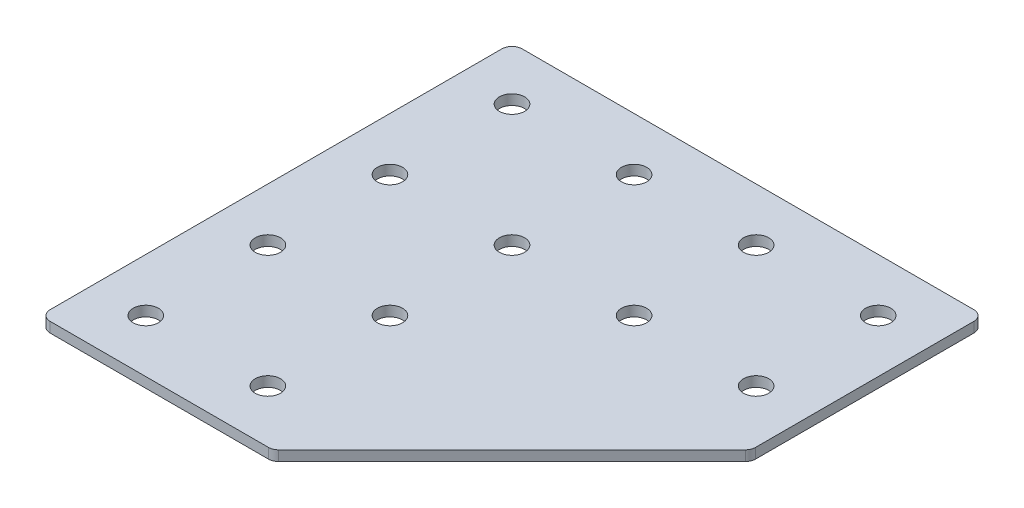
ISO-10303-21;
HEADER;
FILE_DESCRIPTION(('STEP AP214'),'2;1');
FILE_NAME('part.step','',(''),(''),'','','');
FILE_SCHEMA(('AUTOMOTIVE_DESIGN { 1 0 10303 214 1 1 1 1 }'));
ENDSEC;
DATA;
#1=APPLICATION_CONTEXT('core data for automotive mechanical design processes');
#2=APPLICATION_PROTOCOL_DEFINITION('international standard','automotive_design',2000,#1);
#3=PRODUCT_CONTEXT('',#1,'mechanical');
#4=PRODUCT('Part','Part','',(#3));
#5=PRODUCT_RELATED_PRODUCT_CATEGORY('part','',(#4));
#6=PRODUCT_DEFINITION_FORMATION('','',#4);
#7=PRODUCT_DEFINITION_CONTEXT('part definition',#1,'design');
#8=PRODUCT_DEFINITION('design','',#6,#7);
#9=PRODUCT_DEFINITION_SHAPE('','',#8);
#10=(LENGTH_UNIT() NAMED_UNIT(*) SI_UNIT(.MILLI.,.METRE.));
#11=(NAMED_UNIT(*) PLANE_ANGLE_UNIT() SI_UNIT($,.RADIAN.));
#12=(NAMED_UNIT(*) SI_UNIT($,.STERADIAN.) SOLID_ANGLE_UNIT());
#13=UNCERTAINTY_MEASURE_WITH_UNIT(LENGTH_MEASURE(1.E-05),#10,'distance_accuracy_value','');
#14=(GEOMETRIC_REPRESENTATION_CONTEXT(3) GLOBAL_UNCERTAINTY_ASSIGNED_CONTEXT((#13)) GLOBAL_UNIT_ASSIGNED_CONTEXT((#10,
#11,#12)) REPRESENTATION_CONTEXT('',''));
#15=CARTESIAN_POINT('',(0.,0.,0.));
#16=DIRECTION('',(0.,0.,1.));
#17=DIRECTION('',(1.,0.,0.));
#18=AXIS2_PLACEMENT_3D('',#15,#16,#17);
#19=CARTESIAN_POINT('',(-31.7707239678656,0.591431359650869,-30.07040813216));
#20=DIRECTION('',(0.,-1.,0.));
#21=DIRECTION('',(0.,0.,-1.));
#22=AXIS2_PLACEMENT_3D('',#19,#20,#21);
#23=PLANE('',#22);
#24=CARTESIAN_POINT('',(43.2292760321344,0.591431359650869,-15.07040813216));
#25=DIRECTION('',(0.,1.,0.));
#26=DIRECTION('',(0.,0.,1.));
#27=AXIS2_PLACEMENT_3D('',#24,#25,#26);
#28=CIRCLE('',#27,3.1);
#29=CARTESIAN_POINT('',(43.2292760321344,0.591431359650869,-11.97040813216));
#30=VERTEX_POINT('',#29);
#31=EDGE_CURVE('E275',#30,#30,#28,.T.);
#32=ORIENTED_EDGE('',*,*,#31,.T.);
#33=EDGE_LOOP('',(#32));
#34=FACE_BOUND('',#33,.T.);
#35=CARTESIAN_POINT('',(13.2292760321344,0.591431359650869,-15.07040813216));
#36=DIRECTION('',(0.,1.,0.));
#37=DIRECTION('',(0.,0.,1.));
#38=AXIS2_PLACEMENT_3D('',#35,#36,#37);
#39=CIRCLE('',#38,3.1);
#40=CARTESIAN_POINT('',(13.2292760321344,0.591431359650869,-11.97040813216));
#41=VERTEX_POINT('',#40);
#42=EDGE_CURVE('E283',#41,#41,#39,.T.);
#43=ORIENTED_EDGE('',*,*,#42,.T.);
#44=EDGE_LOOP('',(#43));
#45=FACE_BOUND('',#44,.T.);
#46=CARTESIAN_POINT('',(-16.7707239678656,0.591431359650869,44.92959186784));
#47=DIRECTION('',(0.,1.,0.));
#48=DIRECTION('',(0.,0.,1.));
#49=AXIS2_PLACEMENT_3D('',#46,#47,#48);
#50=CIRCLE('',#49,3.1);
#51=CARTESIAN_POINT('',(-16.7707239678656,0.591431359650869,48.0295918678399));
#52=VERTEX_POINT('',#51);
#53=EDGE_CURVE('E289',#52,#52,#50,.T.);
#54=ORIENTED_EDGE('',*,*,#53,.T.);
#55=EDGE_LOOP('',(#54));
#56=FACE_BOUND('',#55,.T.);
#57=CARTESIAN_POINT('',(-46.7707239678656,0.591431359650869,44.92959186784));
#58=DIRECTION('',(0.,1.,0.));
#59=DIRECTION('',(0.,0.,1.));
#60=AXIS2_PLACEMENT_3D('',#57,#58,#59);
#61=CIRCLE('',#60,3.1);
#62=CARTESIAN_POINT('',(-46.7707239678656,0.591431359650869,48.0295918678399));
#63=VERTEX_POINT('',#62);
#64=EDGE_CURVE('E295',#63,#63,#61,.T.);
#65=ORIENTED_EDGE('',*,*,#64,.T.);
#66=EDGE_LOOP('',(#65));
#67=FACE_BOUND('',#66,.T.);
#68=CARTESIAN_POINT('',(-16.7707239678656,0.591431359650869,14.92959186784));
#69=DIRECTION('',(0.,1.,0.));
#70=DIRECTION('',(0.,0.,1.));
#71=AXIS2_PLACEMENT_3D('',#68,#69,#70);
#72=CIRCLE('',#71,3.1);
#73=CARTESIAN_POINT('',(-16.7707239678656,0.591431359650869,18.02959186784));
#74=VERTEX_POINT('',#73);
#75=EDGE_CURVE('E301',#74,#74,#72,.T.);
#76=ORIENTED_EDGE('',*,*,#75,.T.);
#77=EDGE_LOOP('',(#76));
#78=FACE_BOUND('',#77,.T.);
#79=CARTESIAN_POINT('',(-46.7707239678656,0.591431359650869,14.92959186784));
#80=DIRECTION('',(0.,1.,0.));
#81=DIRECTION('',(0.,0.,1.));
#82=AXIS2_PLACEMENT_3D('',#79,#80,#81);
#83=CIRCLE('',#82,3.1);
#84=CARTESIAN_POINT('',(-46.7707239678656,0.591431359650869,18.02959186784));
#85=VERTEX_POINT('',#84);
#86=EDGE_CURVE('E307',#85,#85,#83,.T.);
#87=ORIENTED_EDGE('',*,*,#86,.T.);
#88=EDGE_LOOP('',(#87));
#89=FACE_BOUND('',#88,.T.);
#90=CARTESIAN_POINT('',(-16.7707239678656,0.591431359650869,-15.07040813216));
#91=DIRECTION('',(0.,1.,0.));
#92=DIRECTION('',(0.,0.,1.));
#93=AXIS2_PLACEMENT_3D('',#90,#91,#92);
#94=CIRCLE('',#93,3.1);
#95=CARTESIAN_POINT('',(-16.7707239678656,0.591431359650869,-11.97040813216));
#96=VERTEX_POINT('',#95);
#97=EDGE_CURVE('E313',#96,#96,#94,.T.);
#98=ORIENTED_EDGE('',*,*,#97,.T.);
#99=EDGE_LOOP('',(#98));
#100=FACE_BOUND('',#99,.T.);
#101=CARTESIAN_POINT('',(-46.7707239678656,0.591431359650869,-15.07040813216));
#102=DIRECTION('',(0.,1.,0.));
#103=DIRECTION('',(0.,0.,1.));
#104=AXIS2_PLACEMENT_3D('',#101,#102,#103);
#105=CIRCLE('',#104,3.1);
#106=CARTESIAN_POINT('',(-46.7707239678656,0.591431359650869,-11.97040813216));
#107=VERTEX_POINT('',#106);
#108=EDGE_CURVE('E319',#107,#107,#105,.T.);
#109=ORIENTED_EDGE('',*,*,#108,.T.);
#110=EDGE_LOOP('',(#109));
#111=FACE_BOUND('',#110,.T.);
#112=CARTESIAN_POINT('',(43.2292760321344,0.591431359650869,-45.07040813216));
#113=DIRECTION('',(0.,1.,0.));
#114=DIRECTION('',(0.,0.,1.));
#115=AXIS2_PLACEMENT_3D('',#112,#113,#114);
#116=CIRCLE('',#115,3.1);
#117=CARTESIAN_POINT('',(43.2292760321344,0.591431359650869,-41.97040813216));
#118=VERTEX_POINT('',#117);
#119=EDGE_CURVE('E325',#118,#118,#116,.T.);
#120=ORIENTED_EDGE('',*,*,#119,.T.);
#121=EDGE_LOOP('',(#120));
#122=FACE_BOUND('',#121,.T.);
#123=CARTESIAN_POINT('',(13.2292760321344,0.591431359650869,-45.07040813216));
#124=DIRECTION('',(0.,1.,0.));
#125=DIRECTION('',(0.,0.,1.));
#126=AXIS2_PLACEMENT_3D('',#123,#124,#125);
#127=CIRCLE('',#126,3.1);
#128=CARTESIAN_POINT('',(13.2292760321344,0.591431359650869,-41.97040813216));
#129=VERTEX_POINT('',#128);
#130=EDGE_CURVE('E331',#129,#129,#127,.T.);
#131=ORIENTED_EDGE('',*,*,#130,.T.);
#132=EDGE_LOOP('',(#131));
#133=FACE_BOUND('',#132,.T.);
#134=CARTESIAN_POINT('',(-16.7707239678656,0.591431359650869,-45.07040813216));
#135=DIRECTION('',(0.,1.,0.));
#136=DIRECTION('',(0.,0.,1.));
#137=AXIS2_PLACEMENT_3D('',#134,#135,#136);
#138=CIRCLE('',#137,3.1);
#139=CARTESIAN_POINT('',(-16.7707239678656,0.591431359650869,-41.97040813216));
#140=VERTEX_POINT('',#139);
#141=EDGE_CURVE('E337',#140,#140,#138,.T.);
#142=ORIENTED_EDGE('',*,*,#141,.T.);
#143=EDGE_LOOP('',(#142));
#144=FACE_BOUND('',#143,.T.);
#145=CARTESIAN_POINT('',(-46.7707239678656,0.591431359650869,-45.07040813216));
#146=DIRECTION('',(0.,1.,0.));
#147=DIRECTION('',(0.,0.,1.));
#148=AXIS2_PLACEMENT_3D('',#145,#146,#147);
#149=CIRCLE('',#148,3.1);
#150=CARTESIAN_POINT('',(-46.7707239678656,0.591431359650869,-41.97040813216));
#151=VERTEX_POINT('',#150);
#152=EDGE_CURVE('E175',#151,#151,#149,.T.);
#153=ORIENTED_EDGE('',*,*,#152,.T.);
#154=EDGE_LOOP('',(#153));
#155=FACE_BOUND('',#154,.T.);
#156=DIRECTION('',(1.,0.,0.));
#157=VECTOR('',#156,1.);
#158=CARTESIAN_POINT('',(-59.7707239678657,0.591431359650869,57.9295918678399));
#159=LINE('',#158,#157);
#160=CARTESIAN_POINT('',(-57.2707239678657,0.591431359650869,57.9295918678399));
#161=VERTEX_POINT('',#160);
#162=CARTESIAN_POINT('',(-3.63468499854441,0.591431359650869,57.9295918678399));
#163=VERTEX_POINT('',#162);
#164=EDGE_CURVE('E121',#161,#163,#159,.T.);
#165=ORIENTED_EDGE('',*,*,#164,.F.);
#166=CARTESIAN_POINT('',(-57.2707239678657,0.591431359650869,55.4295918678399));
#167=DIRECTION('',(0.,-1.,0.));
#168=DIRECTION('',(0.,0.,-1.));
#169=AXIS2_PLACEMENT_3D('',#166,#167,#168);
#170=CIRCLE('',#169,2.5);
#171=CARTESIAN_POINT('',(-59.7707239678657,0.591431359650869,55.4295918678399));
#172=VERTEX_POINT('',#171);
#173=EDGE_CURVE('E145',#161,#172,#170,.T.);
#174=ORIENTED_EDGE('',*,*,#173,.T.);
#175=DIRECTION('',(0.,0.,1.));
#176=VECTOR('',#175,1.);
#177=CARTESIAN_POINT('',(-59.7707239678657,0.591431359650869,-58.0704081321601));
#178=LINE('',#177,#176);
#179=CARTESIAN_POINT('',(-59.7707239678657,0.591431359650869,-55.5704081321601));
#180=VERTEX_POINT('',#179);
#181=EDGE_CURVE('E162',#180,#172,#178,.T.);
#182=ORIENTED_EDGE('',*,*,#181,.F.);
#183=CARTESIAN_POINT('',(-57.2707239678657,0.591431359650869,-55.5704081321601));
#184=DIRECTION('',(0.,-1.,0.));
#185=DIRECTION('',(0.,0.,-1.));
#186=AXIS2_PLACEMENT_3D('',#183,#184,#185);
#187=CIRCLE('',#186,2.5);
#188=CARTESIAN_POINT('',(-57.2707239678657,0.591431359650869,-58.0704081321601));
#189=VERTEX_POINT('',#188);
#190=EDGE_CURVE('E117',#180,#189,#187,.T.);
#191=ORIENTED_EDGE('',*,*,#190,.T.);
#192=DIRECTION('',(-1.,0.,0.));
#193=VECTOR('',#192,1.);
#194=CARTESIAN_POINT('',(56.2292760321343,0.591431359650869,-58.0704081321601));
#195=LINE('',#194,#193);
#196=CARTESIAN_POINT('',(53.7292760321343,0.591431359650869,-58.0704081321601));
#197=VERTEX_POINT('',#196);
#198=EDGE_CURVE('E160',#197,#189,#195,.T.);
#199=ORIENTED_EDGE('',*,*,#198,.F.);
#200=CARTESIAN_POINT('',(53.7292760321343,0.591431359650869,-55.5704081321601));
#201=DIRECTION('',(0.,-1.,0.));
#202=DIRECTION('',(0.,0.,-1.));
#203=AXIS2_PLACEMENT_3D('',#200,#201,#202);
#204=CIRCLE('',#203,2.5);
#205=CARTESIAN_POINT('',(56.2292760321343,0.591431359650869,-55.5704081321601));
#206=VERTEX_POINT('',#205);
#207=EDGE_CURVE('E140',#197,#206,#204,.T.);
#208=ORIENTED_EDGE('',*,*,#207,.T.);
#209=DIRECTION('',(0.,0.,-1.));
#210=VECTOR('',#209,1.);
#211=CARTESIAN_POINT('',(56.2292760321343,0.591431359650869,-0.898835256906184));
#212=LINE('',#211,#210);
#213=CARTESIAN_POINT('',(56.2292760321343,0.591431359650869,-1.93436916283891));
#214=VERTEX_POINT('',#213);
#215=EDGE_CURVE('E163',#214,#206,#212,.T.);
#216=ORIENTED_EDGE('',*,*,#215,.F.);
#217=CARTESIAN_POINT('',(53.7292760321343,0.591431359650869,-1.93436916283891));
#218=DIRECTION('',(0.,-1.,0.));
#219=DIRECTION('',(0.,0.,-1.));
#220=AXIS2_PLACEMENT_3D('',#217,#218,#219);
#221=CIRCLE('',#220,2.5);
#222=CARTESIAN_POINT('',(55.4970429851007,0.591431359650869,-0.166602209872545));
#223=VERTEX_POINT('',#222);
#224=EDGE_CURVE('E31',#214,#223,#221,.T.);
#225=ORIENTED_EDGE('',*,*,#224,.T.);
#226=DIRECTION('',(0.707106781186547,0.,-0.707106781186548));
#227=VECTOR('',#226,1.);
#228=CARTESIAN_POINT('',(-2.59915109261168,0.591431359650869,57.9295918678399));
#229=LINE('',#228,#227);
#230=CARTESIAN_POINT('',(-1.86691804557804,0.591431359650869,57.1973588208063));
#231=VERTEX_POINT('',#230);
#232=EDGE_CURVE('E118',#231,#223,#229,.T.);
#233=ORIENTED_EDGE('',*,*,#232,.F.);
#234=CARTESIAN_POINT('',(-3.63468499854441,0.591431359650869,55.4295918678399));
#235=DIRECTION('',(0.,-1.,0.));
#236=DIRECTION('',(0.,0.,-1.));
#237=AXIS2_PLACEMENT_3D('',#234,#235,#236);
#238=CIRCLE('',#237,2.5);
#239=EDGE_CURVE('E143',#231,#163,#238,.T.);
#240=ORIENTED_EDGE('',*,*,#239,.T.);
#241=EDGE_LOOP('',(#165,#174,#182,#191,#199,#208,#216,#225,#233,#240));
#242=FACE_BOUND('',#241,.T.);
#243=ADVANCED_FACE('F16',(#34,#45,#56,#67,#78,#89,#100,#111,#122,#133,#144,#155,#242),#23,.T.);
#244=CARTESIAN_POINT('',(56.2292760321343,0.591431359650869,-0.898835256906184));
#245=DIRECTION('',(1.,0.,0.));
#246=DIRECTION('',(0.,0.,-1.));
#247=AXIS2_PLACEMENT_3D('',#244,#245,#246);
#248=PLANE('',#247);
#249=DIRECTION('',(0.,0.,-1.));
#250=VECTOR('',#249,1.);
#251=CARTESIAN_POINT('',(56.2292760321343,3.09143135965087,-0.898835256906184));
#252=LINE('',#251,#250);
#253=CARTESIAN_POINT('',(56.2292760321343,3.09143135965087,-1.93436916283891));
#254=VERTEX_POINT('',#253);
#255=CARTESIAN_POINT('',(56.2292760321343,3.09143135965087,-55.5704081321601));
#256=VERTEX_POINT('',#255);
#257=EDGE_CURVE('E172',#254,#256,#252,.T.);
#258=ORIENTED_EDGE('',*,*,#257,.F.);
#259=DIRECTION('',(0.,1.,0.));
#260=VECTOR('',#259,1.);
#261=CARTESIAN_POINT('',(56.2292760321343,0.591431359650869,-1.93436916283891));
#262=LINE('',#261,#260);
#263=EDGE_CURVE('E154',#254,#214,#262,.F.);
#264=ORIENTED_EDGE('',*,*,#263,.T.);
#265=ORIENTED_EDGE('',*,*,#215,.T.);
#266=DIRECTION('',(0.,1.,0.));
#267=VECTOR('',#266,1.);
#268=CARTESIAN_POINT('',(56.2292760321343,0.591431359650869,-55.5704081321601));
#269=LINE('',#268,#267);
#270=EDGE_CURVE('E151',#206,#256,#269,.T.);
#271=ORIENTED_EDGE('',*,*,#270,.T.);
#272=EDGE_LOOP('',(#258,#264,#265,#271));
#273=FACE_BOUND('',#272,.T.);
#274=ADVANCED_FACE('F206',(#273),#248,.T.);
#275=CARTESIAN_POINT('',(-2.59915109261168,0.591431359650869,57.9295918678399));
#276=DIRECTION('',(0.707106781186548,0.,0.707106781186547));
#277=DIRECTION('',(0.707106781186547,0.,-0.707106781186548));
#278=AXIS2_PLACEMENT_3D('',#275,#276,#277);
#279=PLANE('',#278);
#280=DIRECTION('',(0.707106781186547,0.,-0.707106781186548));
#281=VECTOR('',#280,1.);
#282=CARTESIAN_POINT('',(-2.59915109261168,3.09143135965087,57.9295918678399));
#283=LINE('',#282,#281);
#284=CARTESIAN_POINT('',(-1.86691804557804,3.09143135965087,57.1973588208063));
#285=VERTEX_POINT('',#284);
#286=CARTESIAN_POINT('',(55.4970429851007,3.09143135965087,-0.166602209872545));
#287=VERTEX_POINT('',#286);
#288=EDGE_CURVE('E124',#285,#287,#283,.T.);
#289=ORIENTED_EDGE('',*,*,#288,.F.);
#290=DIRECTION('',(0.,1.,0.));
#291=VECTOR('',#290,1.);
#292=CARTESIAN_POINT('',(-1.86691804557804,0.591431359650869,57.1973588208063));
#293=LINE('',#292,#291);
#294=EDGE_CURVE('E38',#285,#231,#293,.F.);
#295=ORIENTED_EDGE('',*,*,#294,.T.);
#296=ORIENTED_EDGE('',*,*,#232,.T.);
#297=DIRECTION('',(0.,1.,0.));
#298=VECTOR('',#297,1.);
#299=CARTESIAN_POINT('',(55.4970429851007,0.591431359650869,-0.166602209872545));
#300=LINE('',#299,#298);
#301=EDGE_CURVE('E147',#223,#287,#300,.T.);
#302=ORIENTED_EDGE('',*,*,#301,.T.);
#303=EDGE_LOOP('',(#289,#295,#296,#302));
#304=FACE_BOUND('',#303,.T.);
#305=ADVANCED_FACE('F180',(#304),#279,.T.);
#306=CARTESIAN_POINT('',(-59.7707239678657,0.591431359650869,57.9295918678399));
#307=DIRECTION('',(0.,0.,1.));
#308=DIRECTION('',(1.,0.,0.));
#309=AXIS2_PLACEMENT_3D('',#306,#307,#308);
#310=PLANE('',#309);
#311=DIRECTION('',(1.,0.,0.));
#312=VECTOR('',#311,1.);
#313=CARTESIAN_POINT('',(-59.7707239678657,3.09143135965087,57.9295918678399));
#314=LINE('',#313,#312);
#315=CARTESIAN_POINT('',(-57.2707239678657,3.09143135965087,57.9295918678399));
#316=VERTEX_POINT('',#315);
#317=CARTESIAN_POINT('',(-3.63468499854441,3.09143135965087,57.9295918678399));
#318=VERTEX_POINT('',#317);
#319=EDGE_CURVE('E114',#316,#318,#314,.T.);
#320=ORIENTED_EDGE('',*,*,#319,.F.);
#321=DIRECTION('',(0.,1.,0.));
#322=VECTOR('',#321,1.);
#323=CARTESIAN_POINT('',(-57.2707239678657,0.591431359650869,57.9295918678399));
#324=LINE('',#323,#322);
#325=EDGE_CURVE('E137',#316,#161,#324,.F.);
#326=ORIENTED_EDGE('',*,*,#325,.T.);
#327=ORIENTED_EDGE('',*,*,#164,.T.);
#328=DIRECTION('',(0.,1.,0.));
#329=VECTOR('',#328,1.);
#330=CARTESIAN_POINT('',(-3.63468499854441,0.591431359650869,57.9295918678399));
#331=LINE('',#330,#329);
#332=EDGE_CURVE('E134',#163,#318,#331,.T.);
#333=ORIENTED_EDGE('',*,*,#332,.T.);
#334=EDGE_LOOP('',(#320,#326,#327,#333));
#335=FACE_BOUND('',#334,.T.);
#336=ADVANCED_FACE('F189',(#335),#310,.T.);
#337=CARTESIAN_POINT('',(-59.7707239678657,0.591431359650869,-58.0704081321601));
#338=DIRECTION('',(-1.,0.,0.));
#339=DIRECTION('',(0.,0.,1.));
#340=AXIS2_PLACEMENT_3D('',#337,#338,#339);
#341=PLANE('',#340);
#342=ORIENTED_EDGE('',*,*,#181,.T.);
#343=DIRECTION('',(0.,1.,0.));
#344=VECTOR('',#343,1.);
#345=CARTESIAN_POINT('',(-59.7707239678657,0.591431359650869,55.4295918678399));
#346=LINE('',#345,#344);
#347=CARTESIAN_POINT('',(-59.7707239678657,3.09143135965087,55.4295918678399));
#348=VERTEX_POINT('',#347);
#349=EDGE_CURVE('E105',#172,#348,#346,.T.);
#350=ORIENTED_EDGE('',*,*,#349,.T.);
#351=DIRECTION('',(0.,0.,1.));
#352=VECTOR('',#351,1.);
#353=CARTESIAN_POINT('',(-59.7707239678657,3.09143135965087,-58.0704081321601));
#354=LINE('',#353,#352);
#355=CARTESIAN_POINT('',(-59.7707239678657,3.09143135965087,-55.5704081321601));
#356=VERTEX_POINT('',#355);
#357=EDGE_CURVE('E97',#356,#348,#354,.T.);
#358=ORIENTED_EDGE('',*,*,#357,.F.);
#359=DIRECTION('',(0.,1.,0.));
#360=VECTOR('',#359,1.);
#361=CARTESIAN_POINT('',(-59.7707239678657,0.591431359650869,-55.5704081321601));
#362=LINE('',#361,#360);
#363=EDGE_CURVE('E111',#356,#180,#362,.F.);
#364=ORIENTED_EDGE('',*,*,#363,.T.);
#365=EDGE_LOOP('',(#342,#350,#358,#364));
#366=FACE_BOUND('',#365,.T.);
#367=ADVANCED_FACE('F110',(#366),#341,.T.);
#368=CARTESIAN_POINT('',(56.2292760321343,0.591431359650869,-58.0704081321601));
#369=DIRECTION('',(0.,0.,-1.));
#370=DIRECTION('',(-1.,0.,0.));
#371=AXIS2_PLACEMENT_3D('',#368,#369,#370);
#372=PLANE('',#371);
#373=DIRECTION('',(-1.,0.,0.));
#374=VECTOR('',#373,1.);
#375=CARTESIAN_POINT('',(56.2292760321343,3.09143135965087,-58.0704081321601));
#376=LINE('',#375,#374);
#377=CARTESIAN_POINT('',(53.7292760321343,3.09143135965087,-58.0704081321601));
#378=VERTEX_POINT('',#377);
#379=CARTESIAN_POINT('',(-57.2707239678657,3.09143135965087,-58.0704081321601));
#380=VERTEX_POINT('',#379);
#381=EDGE_CURVE('E99',#378,#380,#376,.T.);
#382=ORIENTED_EDGE('',*,*,#381,.F.);
#383=DIRECTION('',(0.,1.,0.));
#384=VECTOR('',#383,1.);
#385=CARTESIAN_POINT('',(53.7292760321343,0.591431359650869,-58.0704081321601));
#386=LINE('',#385,#384);
#387=EDGE_CURVE('E10',#378,#197,#386,.F.);
#388=ORIENTED_EDGE('',*,*,#387,.T.);
#389=ORIENTED_EDGE('',*,*,#198,.T.);
#390=DIRECTION('',(0.,1.,0.));
#391=VECTOR('',#390,1.);
#392=CARTESIAN_POINT('',(-57.2707239678657,0.591431359650869,-58.0704081321601));
#393=LINE('',#392,#391);
#394=EDGE_CURVE('E24',#189,#380,#393,.T.);
#395=ORIENTED_EDGE('',*,*,#394,.T.);
#396=EDGE_LOOP('',(#382,#388,#389,#395));
#397=FACE_BOUND('',#396,.T.);
#398=ADVANCED_FACE('F157',(#397),#372,.T.);
#399=CARTESIAN_POINT('',(-31.7707239678656,3.09143135965087,-30.07040813216));
#400=DIRECTION('',(0.,-1.,0.));
#401=DIRECTION('',(0.,0.,-1.));
#402=AXIS2_PLACEMENT_3D('',#399,#400,#401);
#403=PLANE('',#402);
#404=CARTESIAN_POINT('',(43.2292760321344,3.09143135965087,-15.07040813216));
#405=DIRECTION('',(0.,1.,0.));
#406=DIRECTION('',(0.,0.,1.));
#407=AXIS2_PLACEMENT_3D('',#404,#405,#406);
#408=CIRCLE('',#407,3.1);
#409=CARTESIAN_POINT('',(43.2292760321344,3.09143135965087,-11.97040813216));
#410=VERTEX_POINT('',#409);
#411=EDGE_CURVE('E278',#410,#410,#408,.T.);
#412=ORIENTED_EDGE('',*,*,#411,.F.);
#413=EDGE_LOOP('',(#412));
#414=FACE_BOUND('',#413,.T.);
#415=CARTESIAN_POINT('',(13.2292760321344,3.09143135965087,-15.07040813216));
#416=DIRECTION('',(0.,1.,0.));
#417=DIRECTION('',(0.,0.,1.));
#418=AXIS2_PLACEMENT_3D('',#415,#416,#417);
#419=CIRCLE('',#418,3.1);
#420=CARTESIAN_POINT('',(13.2292760321344,3.09143135965087,-11.97040813216));
#421=VERTEX_POINT('',#420);
#422=EDGE_CURVE('E280',#421,#421,#419,.T.);
#423=ORIENTED_EDGE('',*,*,#422,.F.);
#424=EDGE_LOOP('',(#423));
#425=FACE_BOUND('',#424,.T.);
#426=CARTESIAN_POINT('',(-16.7707239678656,3.09143135965087,44.92959186784));
#427=DIRECTION('',(0.,1.,0.));
#428=DIRECTION('',(0.,0.,1.));
#429=AXIS2_PLACEMENT_3D('',#426,#427,#428);
#430=CIRCLE('',#429,3.1);
#431=CARTESIAN_POINT('',(-16.7707239678656,3.09143135965087,48.0295918678399));
#432=VERTEX_POINT('',#431);
#433=EDGE_CURVE('E286',#432,#432,#430,.T.);
#434=ORIENTED_EDGE('',*,*,#433,.F.);
#435=EDGE_LOOP('',(#434));
#436=FACE_BOUND('',#435,.T.);
#437=CARTESIAN_POINT('',(-46.7707239678656,3.09143135965087,44.92959186784));
#438=DIRECTION('',(0.,1.,0.));
#439=DIRECTION('',(0.,0.,1.));
#440=AXIS2_PLACEMENT_3D('',#437,#438,#439);
#441=CIRCLE('',#440,3.1);
#442=CARTESIAN_POINT('',(-46.7707239678656,3.09143135965087,48.0295918678399));
#443=VERTEX_POINT('',#442);
#444=EDGE_CURVE('E292',#443,#443,#441,.T.);
#445=ORIENTED_EDGE('',*,*,#444,.F.);
#446=EDGE_LOOP('',(#445));
#447=FACE_BOUND('',#446,.T.);
#448=CARTESIAN_POINT('',(-16.7707239678656,3.09143135965087,14.92959186784));
#449=DIRECTION('',(0.,1.,0.));
#450=DIRECTION('',(0.,0.,1.));
#451=AXIS2_PLACEMENT_3D('',#448,#449,#450);
#452=CIRCLE('',#451,3.1);
#453=CARTESIAN_POINT('',(-16.7707239678656,3.09143135965087,18.02959186784));
#454=VERTEX_POINT('',#453);
#455=EDGE_CURVE('E298',#454,#454,#452,.T.);
#456=ORIENTED_EDGE('',*,*,#455,.F.);
#457=EDGE_LOOP('',(#456));
#458=FACE_BOUND('',#457,.T.);
#459=CARTESIAN_POINT('',(-46.7707239678656,3.09143135965087,14.92959186784));
#460=DIRECTION('',(0.,1.,0.));
#461=DIRECTION('',(0.,0.,1.));
#462=AXIS2_PLACEMENT_3D('',#459,#460,#461);
#463=CIRCLE('',#462,3.1);
#464=CARTESIAN_POINT('',(-46.7707239678656,3.09143135965087,18.02959186784));
#465=VERTEX_POINT('',#464);
#466=EDGE_CURVE('E304',#465,#465,#463,.T.);
#467=ORIENTED_EDGE('',*,*,#466,.F.);
#468=EDGE_LOOP('',(#467));
#469=FACE_BOUND('',#468,.T.);
#470=CARTESIAN_POINT('',(-16.7707239678656,3.09143135965087,-15.07040813216));
#471=DIRECTION('',(0.,1.,0.));
#472=DIRECTION('',(0.,0.,1.));
#473=AXIS2_PLACEMENT_3D('',#470,#471,#472);
#474=CIRCLE('',#473,3.1);
#475=CARTESIAN_POINT('',(-16.7707239678656,3.09143135965087,-11.97040813216));
#476=VERTEX_POINT('',#475);
#477=EDGE_CURVE('E310',#476,#476,#474,.T.);
#478=ORIENTED_EDGE('',*,*,#477,.F.);
#479=EDGE_LOOP('',(#478));
#480=FACE_BOUND('',#479,.T.);
#481=CARTESIAN_POINT('',(-46.7707239678656,3.09143135965087,-15.07040813216));
#482=DIRECTION('',(0.,1.,0.));
#483=DIRECTION('',(0.,0.,1.));
#484=AXIS2_PLACEMENT_3D('',#481,#482,#483);
#485=CIRCLE('',#484,3.1);
#486=CARTESIAN_POINT('',(-46.7707239678656,3.09143135965087,-11.97040813216));
#487=VERTEX_POINT('',#486);
#488=EDGE_CURVE('E316',#487,#487,#485,.T.);
#489=ORIENTED_EDGE('',*,*,#488,.F.);
#490=EDGE_LOOP('',(#489));
#491=FACE_BOUND('',#490,.T.);
#492=CARTESIAN_POINT('',(43.2292760321344,3.09143135965087,-45.07040813216));
#493=DIRECTION('',(0.,1.,0.));
#494=DIRECTION('',(0.,0.,1.));
#495=AXIS2_PLACEMENT_3D('',#492,#493,#494);
#496=CIRCLE('',#495,3.1);
#497=CARTESIAN_POINT('',(43.2292760321344,3.09143135965087,-41.97040813216));
#498=VERTEX_POINT('',#497);
#499=EDGE_CURVE('E322',#498,#498,#496,.T.);
#500=ORIENTED_EDGE('',*,*,#499,.F.);
#501=EDGE_LOOP('',(#500));
#502=FACE_BOUND('',#501,.T.);
#503=CARTESIAN_POINT('',(13.2292760321344,3.09143135965087,-45.07040813216));
#504=DIRECTION('',(0.,1.,0.));
#505=DIRECTION('',(0.,0.,1.));
#506=AXIS2_PLACEMENT_3D('',#503,#504,#505);
#507=CIRCLE('',#506,3.1);
#508=CARTESIAN_POINT('',(13.2292760321344,3.09143135965087,-41.97040813216));
#509=VERTEX_POINT('',#508);
#510=EDGE_CURVE('E328',#509,#509,#507,.T.);
#511=ORIENTED_EDGE('',*,*,#510,.F.);
#512=EDGE_LOOP('',(#511));
#513=FACE_BOUND('',#512,.T.);
#514=CARTESIAN_POINT('',(-16.7707239678656,3.09143135965087,-45.07040813216));
#515=DIRECTION('',(0.,1.,0.));
#516=DIRECTION('',(0.,0.,1.));
#517=AXIS2_PLACEMENT_3D('',#514,#515,#516);
#518=CIRCLE('',#517,3.1);
#519=CARTESIAN_POINT('',(-16.7707239678656,3.09143135965087,-41.97040813216));
#520=VERTEX_POINT('',#519);
#521=EDGE_CURVE('E334',#520,#520,#518,.T.);
#522=ORIENTED_EDGE('',*,*,#521,.F.);
#523=EDGE_LOOP('',(#522));
#524=FACE_BOUND('',#523,.T.);
#525=CARTESIAN_POINT('',(-46.7707239678656,3.09143135965087,-45.07040813216));
#526=DIRECTION('',(0.,1.,0.));
#527=DIRECTION('',(0.,0.,1.));
#528=AXIS2_PLACEMENT_3D('',#525,#526,#527);
#529=CIRCLE('',#528,3.1);
#530=CARTESIAN_POINT('',(-46.7707239678656,3.09143135965087,-41.97040813216));
#531=VERTEX_POINT('',#530);
#532=EDGE_CURVE('E340',#531,#531,#529,.T.);
#533=ORIENTED_EDGE('',*,*,#532,.F.);
#534=EDGE_LOOP('',(#533));
#535=FACE_BOUND('',#534,.T.);
#536=ORIENTED_EDGE('',*,*,#357,.T.);
#537=CARTESIAN_POINT('',(-57.2707239678657,3.09143135965087,55.4295918678399));
#538=DIRECTION('',(0.,-1.,0.));
#539=DIRECTION('',(0.,0.,-1.));
#540=AXIS2_PLACEMENT_3D('',#537,#538,#539);
#541=CIRCLE('',#540,2.5);
#542=EDGE_CURVE('E132',#348,#316,#541,.F.);
#543=ORIENTED_EDGE('',*,*,#542,.T.);
#544=ORIENTED_EDGE('',*,*,#319,.T.);
#545=CARTESIAN_POINT('',(-3.63468499854441,3.09143135965087,55.4295918678399));
#546=DIRECTION('',(0.,-1.,0.));
#547=DIRECTION('',(0.,0.,-1.));
#548=AXIS2_PLACEMENT_3D('',#545,#546,#547);
#549=CIRCLE('',#548,2.5);
#550=EDGE_CURVE('E130',#318,#285,#549,.F.);
#551=ORIENTED_EDGE('',*,*,#550,.T.);
#552=ORIENTED_EDGE('',*,*,#288,.T.);
#553=CARTESIAN_POINT('',(53.7292760321343,3.09143135965087,-1.93436916283891));
#554=DIRECTION('',(0.,-1.,0.));
#555=DIRECTION('',(0.,0.,-1.));
#556=AXIS2_PLACEMENT_3D('',#553,#554,#555);
#557=CIRCLE('',#556,2.5);
#558=EDGE_CURVE('E128',#287,#254,#557,.F.);
#559=ORIENTED_EDGE('',*,*,#558,.T.);
#560=ORIENTED_EDGE('',*,*,#257,.T.);
#561=CARTESIAN_POINT('',(53.7292760321343,3.09143135965087,-55.5704081321601));
#562=DIRECTION('',(0.,-1.,0.));
#563=DIRECTION('',(0.,0.,-1.));
#564=AXIS2_PLACEMENT_3D('',#561,#562,#563);
#565=CIRCLE('',#564,2.5);
#566=EDGE_CURVE('E104',#256,#378,#565,.F.);
#567=ORIENTED_EDGE('',*,*,#566,.T.);
#568=ORIENTED_EDGE('',*,*,#381,.T.);
#569=CARTESIAN_POINT('',(-57.2707239678657,3.09143135965087,-55.5704081321601));
#570=DIRECTION('',(0.,-1.,0.));
#571=DIRECTION('',(0.,0.,-1.));
#572=AXIS2_PLACEMENT_3D('',#569,#570,#571);
#573=CIRCLE('',#572,2.5);
#574=EDGE_CURVE('E94',#380,#356,#573,.F.);
#575=ORIENTED_EDGE('',*,*,#574,.T.);
#576=EDGE_LOOP('',(#536,#543,#544,#551,#552,#559,#560,#567,#568,#575));
#577=FACE_BOUND('',#576,.T.);
#578=ADVANCED_FACE('F96',(#414,#425,#436,#447,#458,#469,#480,#491,#502,#513,#524,#535,#577),
#403,.F.);
#579=CARTESIAN_POINT('',(-57.2707239678657,0.591431359650869,55.4295918678399));
#580=DIRECTION('',(0.,1.,0.));
#581=DIRECTION('',(0.,0.,1.));
#582=AXIS2_PLACEMENT_3D('',#579,#580,#581);
#583=CYLINDRICAL_SURFACE('',#582,2.5);
#584=ORIENTED_EDGE('',*,*,#173,.F.);
#585=ORIENTED_EDGE('',*,*,#325,.F.);
#586=ORIENTED_EDGE('',*,*,#542,.F.);
#587=ORIENTED_EDGE('',*,*,#349,.F.);
#588=EDGE_LOOP('',(#584,#585,#586,#587));
#589=FACE_BOUND('',#588,.T.);
#590=ADVANCED_FACE('F192',(#589),#583,.T.);
#591=CARTESIAN_POINT('',(-3.63468499854441,0.591431359650869,55.4295918678399));
#592=DIRECTION('',(0.,1.,0.));
#593=DIRECTION('',(0.,0.,1.));
#594=AXIS2_PLACEMENT_3D('',#591,#592,#593);
#595=CYLINDRICAL_SURFACE('',#594,2.5);
#596=ORIENTED_EDGE('',*,*,#239,.F.);
#597=ORIENTED_EDGE('',*,*,#294,.F.);
#598=ORIENTED_EDGE('',*,*,#550,.F.);
#599=ORIENTED_EDGE('',*,*,#332,.F.);
#600=EDGE_LOOP('',(#596,#597,#598,#599));
#601=FACE_BOUND('',#600,.T.);
#602=ADVANCED_FACE('F184',(#601),#595,.T.);
#603=CARTESIAN_POINT('',(53.7292760321343,0.591431359650869,-1.93436916283891));
#604=DIRECTION('',(0.,1.,0.));
#605=DIRECTION('',(0.,0.,1.));
#606=AXIS2_PLACEMENT_3D('',#603,#604,#605);
#607=CYLINDRICAL_SURFACE('',#606,2.5);
#608=ORIENTED_EDGE('',*,*,#224,.F.);
#609=ORIENTED_EDGE('',*,*,#263,.F.);
#610=ORIENTED_EDGE('',*,*,#558,.F.);
#611=ORIENTED_EDGE('',*,*,#301,.F.);
#612=EDGE_LOOP('',(#608,#609,#610,#611));
#613=FACE_BOUND('',#612,.T.);
#614=ADVANCED_FACE('F200',(#613),#607,.T.);
#615=CARTESIAN_POINT('',(53.7292760321343,0.591431359650869,-55.5704081321601));
#616=DIRECTION('',(0.,1.,0.));
#617=DIRECTION('',(0.,0.,1.));
#618=AXIS2_PLACEMENT_3D('',#615,#616,#617);
#619=CYLINDRICAL_SURFACE('',#618,2.5);
#620=ORIENTED_EDGE('',*,*,#207,.F.);
#621=ORIENTED_EDGE('',*,*,#387,.F.);
#622=ORIENTED_EDGE('',*,*,#566,.F.);
#623=ORIENTED_EDGE('',*,*,#270,.F.);
#624=EDGE_LOOP('',(#620,#621,#622,#623));
#625=FACE_BOUND('',#624,.T.);
#626=ADVANCED_FACE('F451',(#625),#619,.T.);
#627=CARTESIAN_POINT('',(-57.2707239678657,0.591431359650869,-55.5704081321601));
#628=DIRECTION('',(0.,1.,0.));
#629=DIRECTION('',(0.,0.,1.));
#630=AXIS2_PLACEMENT_3D('',#627,#628,#629);
#631=CYLINDRICAL_SURFACE('',#630,2.5);
#632=ORIENTED_EDGE('',*,*,#190,.F.);
#633=ORIENTED_EDGE('',*,*,#363,.F.);
#634=ORIENTED_EDGE('',*,*,#574,.F.);
#635=ORIENTED_EDGE('',*,*,#394,.F.);
#636=EDGE_LOOP('',(#632,#633,#634,#635));
#637=FACE_BOUND('',#636,.T.);
#638=ADVANCED_FACE('F18',(#637),#631,.T.);
#639=CARTESIAN_POINT('',(-46.7707239678656,0.591431359650869,-45.07040813216));
#640=DIRECTION('',(0.,1.,0.));
#641=DIRECTION('',(0.,0.,1.));
#642=AXIS2_PLACEMENT_3D('',#639,#640,#641);
#643=CYLINDRICAL_SURFACE('',#642,3.1);
#644=ORIENTED_EDGE('',*,*,#152,.F.);
#645=EDGE_LOOP('',(#644));
#646=FACE_BOUND('',#645,.T.);
#647=ORIENTED_EDGE('',*,*,#532,.T.);
#648=EDGE_LOOP('',(#647));
#649=FACE_BOUND('',#648,.T.);
#650=ADVANCED_FACE('F224',(#646,#649),#643,.F.);
#651=CARTESIAN_POINT('',(-16.7707239678656,0.591431359650869,-45.07040813216));
#652=DIRECTION('',(0.,1.,0.));
#653=DIRECTION('',(0.,0.,1.));
#654=AXIS2_PLACEMENT_3D('',#651,#652,#653);
#655=CYLINDRICAL_SURFACE('',#654,3.1);
#656=ORIENTED_EDGE('',*,*,#141,.F.);
#657=EDGE_LOOP('',(#656));
#658=FACE_BOUND('',#657,.T.);
#659=ORIENTED_EDGE('',*,*,#521,.T.);
#660=EDGE_LOOP('',(#659));
#661=FACE_BOUND('',#660,.T.);
#662=ADVANCED_FACE('F227',(#658,#661),#655,.F.);
#663=CARTESIAN_POINT('',(13.2292760321344,0.591431359650869,-45.07040813216));
#664=DIRECTION('',(0.,1.,0.));
#665=DIRECTION('',(0.,0.,1.));
#666=AXIS2_PLACEMENT_3D('',#663,#664,#665);
#667=CYLINDRICAL_SURFACE('',#666,3.1);
#668=ORIENTED_EDGE('',*,*,#130,.F.);
#669=EDGE_LOOP('',(#668));
#670=FACE_BOUND('',#669,.T.);
#671=ORIENTED_EDGE('',*,*,#510,.T.);
#672=EDGE_LOOP('',(#671));
#673=FACE_BOUND('',#672,.T.);
#674=ADVANCED_FACE('F231',(#670,#673),#667,.F.);
#675=CARTESIAN_POINT('',(43.2292760321344,0.591431359650869,-45.07040813216));
#676=DIRECTION('',(0.,1.,0.));
#677=DIRECTION('',(0.,0.,1.));
#678=AXIS2_PLACEMENT_3D('',#675,#676,#677);
#679=CYLINDRICAL_SURFACE('',#678,3.1);
#680=ORIENTED_EDGE('',*,*,#119,.F.);
#681=EDGE_LOOP('',(#680));
#682=FACE_BOUND('',#681,.T.);
#683=ORIENTED_EDGE('',*,*,#499,.T.);
#684=EDGE_LOOP('',(#683));
#685=FACE_BOUND('',#684,.T.);
#686=ADVANCED_FACE('F235',(#682,#685),#679,.F.);
#687=CARTESIAN_POINT('',(-46.7707239678656,0.591431359650869,-15.07040813216));
#688=DIRECTION('',(0.,1.,0.));
#689=DIRECTION('',(0.,0.,1.));
#690=AXIS2_PLACEMENT_3D('',#687,#688,#689);
#691=CYLINDRICAL_SURFACE('',#690,3.1);
#692=ORIENTED_EDGE('',*,*,#108,.F.);
#693=EDGE_LOOP('',(#692));
#694=FACE_BOUND('',#693,.T.);
#695=ORIENTED_EDGE('',*,*,#488,.T.);
#696=EDGE_LOOP('',(#695));
#697=FACE_BOUND('',#696,.T.);
#698=ADVANCED_FACE('F239',(#694,#697),#691,.F.);
#699=CARTESIAN_POINT('',(-16.7707239678656,0.591431359650869,-15.07040813216));
#700=DIRECTION('',(0.,1.,0.));
#701=DIRECTION('',(0.,0.,1.));
#702=AXIS2_PLACEMENT_3D('',#699,#700,#701);
#703=CYLINDRICAL_SURFACE('',#702,3.1);
#704=ORIENTED_EDGE('',*,*,#97,.F.);
#705=EDGE_LOOP('',(#704));
#706=FACE_BOUND('',#705,.T.);
#707=ORIENTED_EDGE('',*,*,#477,.T.);
#708=EDGE_LOOP('',(#707));
#709=FACE_BOUND('',#708,.T.);
#710=ADVANCED_FACE('F243',(#706,#709),#703,.F.);
#711=CARTESIAN_POINT('',(-46.7707239678656,0.591431359650869,14.92959186784));
#712=DIRECTION('',(0.,1.,0.));
#713=DIRECTION('',(0.,0.,1.));
#714=AXIS2_PLACEMENT_3D('',#711,#712,#713);
#715=CYLINDRICAL_SURFACE('',#714,3.1);
#716=ORIENTED_EDGE('',*,*,#86,.F.);
#717=EDGE_LOOP('',(#716));
#718=FACE_BOUND('',#717,.T.);
#719=ORIENTED_EDGE('',*,*,#466,.T.);
#720=EDGE_LOOP('',(#719));
#721=FACE_BOUND('',#720,.T.);
#722=ADVANCED_FACE('F247',(#718,#721),#715,.F.);
#723=CARTESIAN_POINT('',(-16.7707239678656,0.591431359650869,14.92959186784));
#724=DIRECTION('',(0.,1.,0.));
#725=DIRECTION('',(0.,0.,1.));
#726=AXIS2_PLACEMENT_3D('',#723,#724,#725);
#727=CYLINDRICAL_SURFACE('',#726,3.1);
#728=ORIENTED_EDGE('',*,*,#75,.F.);
#729=EDGE_LOOP('',(#728));
#730=FACE_BOUND('',#729,.T.);
#731=ORIENTED_EDGE('',*,*,#455,.T.);
#732=EDGE_LOOP('',(#731));
#733=FACE_BOUND('',#732,.T.);
#734=ADVANCED_FACE('F251',(#730,#733),#727,.F.);
#735=CARTESIAN_POINT('',(-46.7707239678656,0.591431359650869,44.92959186784));
#736=DIRECTION('',(0.,1.,0.));
#737=DIRECTION('',(0.,0.,1.));
#738=AXIS2_PLACEMENT_3D('',#735,#736,#737);
#739=CYLINDRICAL_SURFACE('',#738,3.1);
#740=ORIENTED_EDGE('',*,*,#64,.F.);
#741=EDGE_LOOP('',(#740));
#742=FACE_BOUND('',#741,.T.);
#743=ORIENTED_EDGE('',*,*,#444,.T.);
#744=EDGE_LOOP('',(#743));
#745=FACE_BOUND('',#744,.T.);
#746=ADVANCED_FACE('F255',(#742,#745),#739,.F.);
#747=CARTESIAN_POINT('',(-16.7707239678656,0.591431359650869,44.92959186784));
#748=DIRECTION('',(0.,1.,0.));
#749=DIRECTION('',(0.,0.,1.));
#750=AXIS2_PLACEMENT_3D('',#747,#748,#749);
#751=CYLINDRICAL_SURFACE('',#750,3.1);
#752=ORIENTED_EDGE('',*,*,#53,.F.);
#753=EDGE_LOOP('',(#752));
#754=FACE_BOUND('',#753,.T.);
#755=ORIENTED_EDGE('',*,*,#433,.T.);
#756=EDGE_LOOP('',(#755));
#757=FACE_BOUND('',#756,.T.);
#758=ADVANCED_FACE('F259',(#754,#757),#751,.F.);
#759=CARTESIAN_POINT('',(13.2292760321344,0.591431359650869,-15.07040813216));
#760=DIRECTION('',(0.,1.,0.));
#761=DIRECTION('',(0.,0.,1.));
#762=AXIS2_PLACEMENT_3D('',#759,#760,#761);
#763=CYLINDRICAL_SURFACE('',#762,3.1);
#764=ORIENTED_EDGE('',*,*,#42,.F.);
#765=EDGE_LOOP('',(#764));
#766=FACE_BOUND('',#765,.T.);
#767=ORIENTED_EDGE('',*,*,#422,.T.);
#768=EDGE_LOOP('',(#767));
#769=FACE_BOUND('',#768,.T.);
#770=ADVANCED_FACE('F263',(#766,#769),#763,.F.);
#771=CARTESIAN_POINT('',(43.2292760321344,0.591431359650869,-15.07040813216));
#772=DIRECTION('',(0.,1.,0.));
#773=DIRECTION('',(0.,0.,1.));
#774=AXIS2_PLACEMENT_3D('',#771,#772,#773);
#775=CYLINDRICAL_SURFACE('',#774,3.1);
#776=ORIENTED_EDGE('',*,*,#31,.F.);
#777=EDGE_LOOP('',(#776));
#778=FACE_BOUND('',#777,.T.);
#779=ORIENTED_EDGE('',*,*,#411,.T.);
#780=EDGE_LOOP('',(#779));
#781=FACE_BOUND('',#780,.T.);
#782=ADVANCED_FACE('F267',(#778,#781),#775,.F.);
#783=CLOSED_SHELL('',(#243,#274,#305,#336,#367,#398,#578,#590,#602,#614,#626,#638,#650,#662,
#674,#686,#698,#710,#722,#734,#746,#758,#770,#782));
#784=MANIFOLD_SOLID_BREP('B1',#783);
#785=ADVANCED_BREP_SHAPE_REPRESENTATION('',(#18,#784),#14);
#786=SHAPE_DEFINITION_REPRESENTATION(#9,#785);
ENDSEC;
END-ISO-10303-21;
